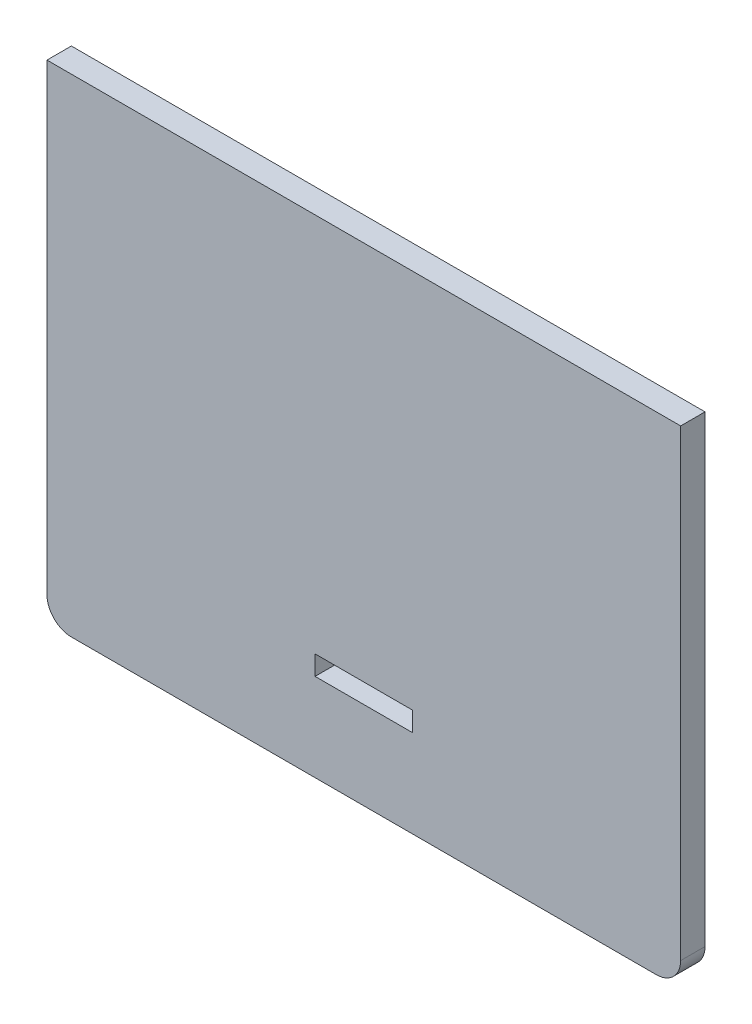
ISO-10303-21;
HEADER;
FILE_DESCRIPTION(('STEP AP214'),'2;1');
FILE_NAME('part.step','',(''),(''),'','','');
FILE_SCHEMA(('AUTOMOTIVE_DESIGN { 1 0 10303 214 1 1 1 1 }'));
ENDSEC;
DATA;
#1=APPLICATION_CONTEXT('core data for automotive mechanical design processes');
#2=APPLICATION_PROTOCOL_DEFINITION('international standard','automotive_design',2000,#1);
#3=PRODUCT_CONTEXT('',#1,'mechanical');
#4=PRODUCT('Part','Part','',(#3));
#5=PRODUCT_RELATED_PRODUCT_CATEGORY('part','',(#4));
#6=PRODUCT_DEFINITION_FORMATION('','',#4);
#7=PRODUCT_DEFINITION_CONTEXT('part definition',#1,'design');
#8=PRODUCT_DEFINITION('design','',#6,#7);
#9=PRODUCT_DEFINITION_SHAPE('','',#8);
#10=(LENGTH_UNIT() NAMED_UNIT(*) SI_UNIT(.MILLI.,.METRE.));
#11=(NAMED_UNIT(*) PLANE_ANGLE_UNIT() SI_UNIT($,.RADIAN.));
#12=(NAMED_UNIT(*) SI_UNIT($,.STERADIAN.) SOLID_ANGLE_UNIT());
#13=UNCERTAINTY_MEASURE_WITH_UNIT(LENGTH_MEASURE(1.E-05),#10,'distance_accuracy_value','');
#14=(GEOMETRIC_REPRESENTATION_CONTEXT(3) GLOBAL_UNCERTAINTY_ASSIGNED_CONTEXT((#13)) GLOBAL_UNIT_ASSIGNED_CONTEXT((#10,
#11,#12)) REPRESENTATION_CONTEXT('',''));
#15=CARTESIAN_POINT('',(0.,0.,0.));
#16=DIRECTION('',(0.,0.,1.));
#17=DIRECTION('',(1.,0.,0.));
#18=AXIS2_PLACEMENT_3D('',#15,#16,#17);
#19=CARTESIAN_POINT('',(-65.,-50.,2.5));
#20=DIRECTION('',(0.,1.,0.));
#21=DIRECTION('',(0.,0.,1.));
#22=AXIS2_PLACEMENT_3D('',#19,#20,#21);
#23=PLANE('',#22);
#24=DIRECTION('',(1.,0.,0.));
#25=VECTOR('',#24,1.);
#26=CARTESIAN_POINT('',(-65.,-50.,-2.5));
#27=LINE('',#26,#25);
#28=CARTESIAN_POINT('',(-60.,-50.,-2.5));
#29=VERTEX_POINT('',#28);
#30=CARTESIAN_POINT('',(60.,-50.,-2.5));
#31=VERTEX_POINT('',#30);
#32=EDGE_CURVE('E158',#29,#31,#27,.T.);
#33=ORIENTED_EDGE('',*,*,#32,.T.);
#34=DIRECTION('',(0.,0.,-1.));
#35=VECTOR('',#34,1.);
#36=CARTESIAN_POINT('',(60.,-50.,2.5));
#37=LINE('',#36,#35);
#38=CARTESIAN_POINT('',(60.,-50.,2.5));
#39=VERTEX_POINT('',#38);
#40=EDGE_CURVE('E215',#31,#39,#37,.F.);
#41=ORIENTED_EDGE('',*,*,#40,.T.);
#42=DIRECTION('',(1.,0.,0.));
#43=VECTOR('',#42,1.);
#44=CARTESIAN_POINT('',(-65.,-50.,2.5));
#45=LINE('',#44,#43);
#46=CARTESIAN_POINT('',(-60.,-50.,2.5));
#47=VERTEX_POINT('',#46);
#48=EDGE_CURVE('E164',#47,#39,#45,.T.);
#49=ORIENTED_EDGE('',*,*,#48,.F.);
#50=DIRECTION('',(0.,0.,-1.));
#51=VECTOR('',#50,1.);
#52=CARTESIAN_POINT('',(-60.,-50.,2.5));
#53=LINE('',#52,#51);
#54=EDGE_CURVE('E211',#47,#29,#53,.T.);
#55=ORIENTED_EDGE('',*,*,#54,.T.);
#56=EDGE_LOOP('',(#33,#41,#49,#55));
#57=FACE_BOUND('',#56,.T.);
#58=ADVANCED_FACE('F38',(#57),#23,.F.);
#59=CARTESIAN_POINT('',(65.,50.,2.5));
#60=DIRECTION('',(1.,0.,0.));
#61=DIRECTION('',(0.,1.,0.));
#62=AXIS2_PLACEMENT_3D('',#59,#60,#61);
#63=PLANE('',#62);
#64=DIRECTION('',(0.,-1.,0.));
#65=VECTOR('',#64,1.);
#66=CARTESIAN_POINT('',(65.,50.,2.5));
#67=LINE('',#66,#65);
#68=CARTESIAN_POINT('',(65.,50.,2.5));
#69=VERTEX_POINT('',#68);
#70=CARTESIAN_POINT('',(65.,-45.,2.5));
#71=VERTEX_POINT('',#70);
#72=EDGE_CURVE('E168',#69,#71,#67,.T.);
#73=ORIENTED_EDGE('',*,*,#72,.T.);
#74=DIRECTION('',(0.,0.,-1.));
#75=VECTOR('',#74,1.);
#76=CARTESIAN_POINT('',(65.,-45.,-2.5));
#77=LINE('',#76,#75);
#78=CARTESIAN_POINT('',(65.,-45.,-2.5));
#79=VERTEX_POINT('',#78);
#80=EDGE_CURVE('E201',#71,#79,#77,.T.);
#81=ORIENTED_EDGE('',*,*,#80,.T.);
#82=DIRECTION('',(0.,-1.,0.));
#83=VECTOR('',#82,1.);
#84=CARTESIAN_POINT('',(65.,50.,-2.5));
#85=LINE('',#84,#83);
#86=CARTESIAN_POINT('',(65.,50.,-2.5));
#87=VERTEX_POINT('',#86);
#88=EDGE_CURVE('E185',#87,#79,#85,.T.);
#89=ORIENTED_EDGE('',*,*,#88,.F.);
#90=DIRECTION('',(0.,0.,-1.));
#91=VECTOR('',#90,1.);
#92=CARTESIAN_POINT('',(65.,50.,2.5));
#93=LINE('',#92,#91);
#94=EDGE_CURVE('E198',#69,#87,#93,.T.);
#95=ORIENTED_EDGE('',*,*,#94,.F.);
#96=EDGE_LOOP('',(#73,#81,#89,#95));
#97=FACE_BOUND('',#96,.T.);
#98=ADVANCED_FACE('F231',(#97),#63,.T.);
#99=CARTESIAN_POINT('',(-65.,50.,2.5));
#100=DIRECTION('',(0.,1.,0.));
#101=DIRECTION('',(0.,0.,1.));
#102=AXIS2_PLACEMENT_3D('',#99,#100,#101);
#103=PLANE('',#102);
#104=DIRECTION('',(1.,0.,0.));
#105=VECTOR('',#104,1.);
#106=CARTESIAN_POINT('',(-65.,50.,-2.5));
#107=LINE('',#106,#105);
#108=CARTESIAN_POINT('',(-65.,50.,-2.5));
#109=VERTEX_POINT('',#108);
#110=EDGE_CURVE('E189',#109,#87,#107,.T.);
#111=ORIENTED_EDGE('',*,*,#110,.F.);
#112=DIRECTION('',(0.,0.,-1.));
#113=VECTOR('',#112,1.);
#114=CARTESIAN_POINT('',(-65.,50.,2.5));
#115=LINE('',#114,#113);
#116=CARTESIAN_POINT('',(-65.,50.,2.5));
#117=VERTEX_POINT('',#116);
#118=EDGE_CURVE('E181',#117,#109,#115,.T.);
#119=ORIENTED_EDGE('',*,*,#118,.F.);
#120=DIRECTION('',(1.,0.,0.));
#121=VECTOR('',#120,1.);
#122=CARTESIAN_POINT('',(-65.,50.,2.5));
#123=LINE('',#122,#121);
#124=EDGE_CURVE('E173',#117,#69,#123,.T.);
#125=ORIENTED_EDGE('',*,*,#124,.T.);
#126=ORIENTED_EDGE('',*,*,#94,.T.);
#127=EDGE_LOOP('',(#111,#119,#125,#126));
#128=FACE_BOUND('',#127,.T.);
#129=ADVANCED_FACE('F246',(#128),#103,.T.);
#130=CARTESIAN_POINT('',(-65.,50.,2.5));
#131=DIRECTION('',(1.,0.,0.));
#132=DIRECTION('',(0.,1.,0.));
#133=AXIS2_PLACEMENT_3D('',#130,#131,#132);
#134=PLANE('',#133);
#135=DIRECTION('',(0.,-1.,0.));
#136=VECTOR('',#135,1.);
#137=CARTESIAN_POINT('',(-65.,50.,-2.5));
#138=LINE('',#137,#136);
#139=CARTESIAN_POINT('',(-65.,-45.,-2.5));
#140=VERTEX_POINT('',#139);
#141=EDGE_CURVE('E169',#109,#140,#138,.T.);
#142=ORIENTED_EDGE('',*,*,#141,.T.);
#143=DIRECTION('',(0.,0.,-1.));
#144=VECTOR('',#143,1.);
#145=CARTESIAN_POINT('',(-65.,-45.,2.5));
#146=LINE('',#145,#144);
#147=CARTESIAN_POINT('',(-65.,-45.,2.5));
#148=VERTEX_POINT('',#147);
#149=EDGE_CURVE('E11',#140,#148,#146,.F.);
#150=ORIENTED_EDGE('',*,*,#149,.T.);
#151=DIRECTION('',(0.,-1.,0.));
#152=VECTOR('',#151,1.);
#153=CARTESIAN_POINT('',(-65.,50.,2.5));
#154=LINE('',#153,#152);
#155=EDGE_CURVE('E177',#117,#148,#154,.T.);
#156=ORIENTED_EDGE('',*,*,#155,.F.);
#157=ORIENTED_EDGE('',*,*,#118,.T.);
#158=EDGE_LOOP('',(#142,#150,#156,#157));
#159=FACE_BOUND('',#158,.T.);
#160=ADVANCED_FACE('F243',(#159),#134,.F.);
#161=CARTESIAN_POINT('',(0.,0.,2.5));
#162=DIRECTION('',(0.,0.,-1.));
#163=DIRECTION('',(-1.,0.,0.));
#164=AXIS2_PLACEMENT_3D('',#161,#162,#163);
#165=PLANE('',#164);
#166=DIRECTION('',(-1.,0.,0.));
#167=VECTOR('',#166,1.);
#168=CARTESIAN_POINT('',(-9.99999999999999,-28.,2.5));
#169=LINE('',#168,#167);
#170=CARTESIAN_POINT('',(10.,-28.,2.5));
#171=VERTEX_POINT('',#170);
#172=CARTESIAN_POINT('',(-9.99999999999999,-28.,2.5));
#173=VERTEX_POINT('',#172);
#174=EDGE_CURVE('E149',#171,#173,#169,.T.);
#175=ORIENTED_EDGE('',*,*,#174,.F.);
#176=DIRECTION('',(0.,1.,0.));
#177=VECTOR('',#176,1.);
#178=CARTESIAN_POINT('',(10.,-28.,2.5));
#179=LINE('',#178,#177);
#180=CARTESIAN_POINT('',(10.,-32.,2.5));
#181=VERTEX_POINT('',#180);
#182=EDGE_CURVE('E54',#181,#171,#179,.T.);
#183=ORIENTED_EDGE('',*,*,#182,.F.);
#184=DIRECTION('',(1.,0.,0.));
#185=VECTOR('',#184,1.);
#186=CARTESIAN_POINT('',(-9.99999999999999,-32.,2.5));
#187=LINE('',#186,#185);
#188=CARTESIAN_POINT('',(-9.99999999999999,-32.,2.5));
#189=VERTEX_POINT('',#188);
#190=EDGE_CURVE('E136',#189,#181,#187,.T.);
#191=ORIENTED_EDGE('',*,*,#190,.F.);
#192=DIRECTION('',(0.,-1.,0.));
#193=VECTOR('',#192,1.);
#194=CARTESIAN_POINT('',(-9.99999999999999,-28.,2.5));
#195=LINE('',#194,#193);
#196=EDGE_CURVE('E140',#173,#189,#195,.T.);
#197=ORIENTED_EDGE('',*,*,#196,.F.);
#198=EDGE_LOOP('',(#175,#183,#191,#197));
#199=FACE_BOUND('',#198,.T.);
#200=ORIENTED_EDGE('',*,*,#48,.T.);
#201=CARTESIAN_POINT('',(60.,-45.,2.5));
#202=DIRECTION('',(0.,0.,-1.));
#203=DIRECTION('',(-1.,0.,0.));
#204=AXIS2_PLACEMENT_3D('',#201,#202,#203);
#205=CIRCLE('',#204,5.);
#206=EDGE_CURVE('E47',#39,#71,#205,.F.);
#207=ORIENTED_EDGE('',*,*,#206,.T.);
#208=ORIENTED_EDGE('',*,*,#72,.F.);
#209=ORIENTED_EDGE('',*,*,#124,.F.);
#210=ORIENTED_EDGE('',*,*,#155,.T.);
#211=CARTESIAN_POINT('',(-60.,-45.,2.5));
#212=DIRECTION('',(0.,0.,-1.));
#213=DIRECTION('',(-1.,0.,0.));
#214=AXIS2_PLACEMENT_3D('',#211,#212,#213);
#215=CIRCLE('',#214,5.);
#216=EDGE_CURVE('E218',#148,#47,#215,.F.);
#217=ORIENTED_EDGE('',*,*,#216,.T.);
#218=EDGE_LOOP('',(#200,#207,#208,#209,#210,#217));
#219=FACE_BOUND('',#218,.T.);
#220=ADVANCED_FACE('F224',(#199,#219),#165,.F.);
#221=CARTESIAN_POINT('',(0.,0.,-2.5));
#222=DIRECTION('',(0.,0.,-1.));
#223=DIRECTION('',(-1.,0.,0.));
#224=AXIS2_PLACEMENT_3D('',#221,#222,#223);
#225=PLANE('',#224);
#226=DIRECTION('',(0.,1.,0.));
#227=VECTOR('',#226,1.);
#228=CARTESIAN_POINT('',(10.,-28.,-2.5));
#229=LINE('',#228,#227);
#230=CARTESIAN_POINT('',(10.,-32.,-2.5));
#231=VERTEX_POINT('',#230);
#232=CARTESIAN_POINT('',(10.,-28.,-2.5));
#233=VERTEX_POINT('',#232);
#234=EDGE_CURVE('E117',#231,#233,#229,.T.);
#235=ORIENTED_EDGE('',*,*,#234,.T.);
#236=DIRECTION('',(-1.,0.,0.));
#237=VECTOR('',#236,1.);
#238=CARTESIAN_POINT('',(-9.99999999999999,-28.,-2.5));
#239=LINE('',#238,#237);
#240=CARTESIAN_POINT('',(-9.99999999999999,-28.,-2.5));
#241=VERTEX_POINT('',#240);
#242=EDGE_CURVE('E127',#233,#241,#239,.T.);
#243=ORIENTED_EDGE('',*,*,#242,.T.);
#244=DIRECTION('',(0.,-1.,0.));
#245=VECTOR('',#244,1.);
#246=CARTESIAN_POINT('',(-9.99999999999999,-28.,-2.5));
#247=LINE('',#246,#245);
#248=CARTESIAN_POINT('',(-9.99999999999999,-32.,-2.5));
#249=VERTEX_POINT('',#248);
#250=EDGE_CURVE('E62',#241,#249,#247,.T.);
#251=ORIENTED_EDGE('',*,*,#250,.T.);
#252=DIRECTION('',(1.,0.,0.));
#253=VECTOR('',#252,1.);
#254=CARTESIAN_POINT('',(-9.99999999999999,-32.,-2.5));
#255=LINE('',#254,#253);
#256=EDGE_CURVE('E124',#249,#231,#255,.T.);
#257=ORIENTED_EDGE('',*,*,#256,.T.);
#258=EDGE_LOOP('',(#235,#243,#251,#257));
#259=FACE_BOUND('',#258,.T.);
#260=ORIENTED_EDGE('',*,*,#88,.T.);
#261=CARTESIAN_POINT('',(60.,-45.,-2.5));
#262=DIRECTION('',(0.,0.,-1.));
#263=DIRECTION('',(-1.,0.,0.));
#264=AXIS2_PLACEMENT_3D('',#261,#262,#263);
#265=CIRCLE('',#264,5.);
#266=EDGE_CURVE('E208',#79,#31,#265,.T.);
#267=ORIENTED_EDGE('',*,*,#266,.T.);
#268=ORIENTED_EDGE('',*,*,#32,.F.);
#269=CARTESIAN_POINT('',(-60.,-45.,-2.5));
#270=DIRECTION('',(0.,0.,-1.));
#271=DIRECTION('',(-1.,0.,0.));
#272=AXIS2_PLACEMENT_3D('',#269,#270,#271);
#273=CIRCLE('',#272,5.);
#274=EDGE_CURVE('E205',#29,#140,#273,.T.);
#275=ORIENTED_EDGE('',*,*,#274,.T.);
#276=ORIENTED_EDGE('',*,*,#141,.F.);
#277=ORIENTED_EDGE('',*,*,#110,.T.);
#278=EDGE_LOOP('',(#260,#267,#268,#275,#276,#277));
#279=FACE_BOUND('',#278,.T.);
#280=ADVANCED_FACE('F132',(#259,#279),#225,.T.);
#281=CARTESIAN_POINT('',(60.,-45.,2.5));
#282=DIRECTION('',(0.,0.,1.));
#283=DIRECTION('',(1.,0.,0.));
#284=AXIS2_PLACEMENT_3D('',#281,#282,#283);
#285=CYLINDRICAL_SURFACE('',#284,5.);
#286=ORIENTED_EDGE('',*,*,#206,.F.);
#287=ORIENTED_EDGE('',*,*,#40,.F.);
#288=ORIENTED_EDGE('',*,*,#266,.F.);
#289=ORIENTED_EDGE('',*,*,#80,.F.);
#290=EDGE_LOOP('',(#286,#287,#288,#289));
#291=FACE_BOUND('',#290,.T.);
#292=ADVANCED_FACE('F233',(#291),#285,.T.);
#293=CARTESIAN_POINT('',(-60.,-45.,2.5));
#294=DIRECTION('',(0.,0.,-1.));
#295=DIRECTION('',(-1.,0.,0.));
#296=AXIS2_PLACEMENT_3D('',#293,#294,#295);
#297=CYLINDRICAL_SURFACE('',#296,5.);
#298=ORIENTED_EDGE('',*,*,#216,.F.);
#299=ORIENTED_EDGE('',*,*,#149,.F.);
#300=ORIENTED_EDGE('',*,*,#274,.F.);
#301=ORIENTED_EDGE('',*,*,#54,.F.);
#302=EDGE_LOOP('',(#298,#299,#300,#301));
#303=FACE_BOUND('',#302,.T.);
#304=ADVANCED_FACE('F40',(#303),#297,.T.);
#305=CARTESIAN_POINT('',(10.,-28.,-2.5));
#306=DIRECTION('',(1.,0.,0.));
#307=DIRECTION('',(0.,0.,-1.));
#308=AXIS2_PLACEMENT_3D('',#305,#306,#307);
#309=PLANE('',#308);
#310=ORIENTED_EDGE('',*,*,#182,.T.);
#311=DIRECTION('',(0.,0.,1.));
#312=VECTOR('',#311,1.);
#313=CARTESIAN_POINT('',(10.,-28.,-2.5));
#314=LINE('',#313,#312);
#315=EDGE_CURVE('E113',#233,#171,#314,.T.);
#316=ORIENTED_EDGE('',*,*,#315,.F.);
#317=ORIENTED_EDGE('',*,*,#234,.F.);
#318=DIRECTION('',(0.,0.,1.));
#319=VECTOR('',#318,1.);
#320=CARTESIAN_POINT('',(10.,-32.,-2.5));
#321=LINE('',#320,#319);
#322=EDGE_CURVE('E155',#231,#181,#321,.T.);
#323=ORIENTED_EDGE('',*,*,#322,.T.);
#324=EDGE_LOOP('',(#310,#316,#317,#323));
#325=FACE_BOUND('',#324,.T.);
#326=ADVANCED_FACE('F115',(#325),#309,.F.);
#327=CARTESIAN_POINT('',(-9.99999999999999,-32.,-2.5));
#328=DIRECTION('',(0.,-1.,0.));
#329=DIRECTION('',(0.,0.,-1.));
#330=AXIS2_PLACEMENT_3D('',#327,#328,#329);
#331=PLANE('',#330);
#332=ORIENTED_EDGE('',*,*,#190,.T.);
#333=ORIENTED_EDGE('',*,*,#322,.F.);
#334=ORIENTED_EDGE('',*,*,#256,.F.);
#335=DIRECTION('',(0.,0.,1.));
#336=VECTOR('',#335,1.);
#337=CARTESIAN_POINT('',(-9.99999999999999,-32.,-2.5));
#338=LINE('',#337,#336);
#339=EDGE_CURVE('E159',#249,#189,#338,.T.);
#340=ORIENTED_EDGE('',*,*,#339,.T.);
#341=EDGE_LOOP('',(#332,#333,#334,#340));
#342=FACE_BOUND('',#341,.T.);
#343=ADVANCED_FACE('F273',(#342),#331,.F.);
#344=CARTESIAN_POINT('',(-9.99999999999999,-28.,-2.5));
#345=DIRECTION('',(-1.,0.,0.));
#346=DIRECTION('',(0.,0.,1.));
#347=AXIS2_PLACEMENT_3D('',#344,#345,#346);
#348=PLANE('',#347);
#349=ORIENTED_EDGE('',*,*,#196,.T.);
#350=ORIENTED_EDGE('',*,*,#339,.F.);
#351=ORIENTED_EDGE('',*,*,#250,.F.);
#352=DIRECTION('',(0.,0.,1.));
#353=VECTOR('',#352,1.);
#354=CARTESIAN_POINT('',(-9.99999999999999,-28.,-2.5));
#355=LINE('',#354,#353);
#356=EDGE_CURVE('E123',#241,#173,#355,.T.);
#357=ORIENTED_EDGE('',*,*,#356,.T.);
#358=EDGE_LOOP('',(#349,#350,#351,#357));
#359=FACE_BOUND('',#358,.T.);
#360=ADVANCED_FACE('F276',(#359),#348,.F.);
#361=CARTESIAN_POINT('',(-9.99999999999999,-28.,-2.5));
#362=DIRECTION('',(0.,1.,0.));
#363=DIRECTION('',(0.,0.,1.));
#364=AXIS2_PLACEMENT_3D('',#361,#362,#363);
#365=PLANE('',#364);
#366=ORIENTED_EDGE('',*,*,#174,.T.);
#367=ORIENTED_EDGE('',*,*,#356,.F.);
#368=ORIENTED_EDGE('',*,*,#242,.F.);
#369=ORIENTED_EDGE('',*,*,#315,.T.);
#370=EDGE_LOOP('',(#366,#367,#368,#369));
#371=FACE_BOUND('',#370,.T.);
#372=ADVANCED_FACE('F128',(#371),#365,.F.);
#373=CLOSED_SHELL('',(#58,#98,#129,#160,#220,#280,#292,#304,#326,#343,#360,#372));
#374=MANIFOLD_SOLID_BREP('B2',#373);
#375=ADVANCED_BREP_SHAPE_REPRESENTATION('',(#18,#374),#14);
#376=SHAPE_DEFINITION_REPRESENTATION(#9,#375);
ENDSEC;
END-ISO-10303-21;
